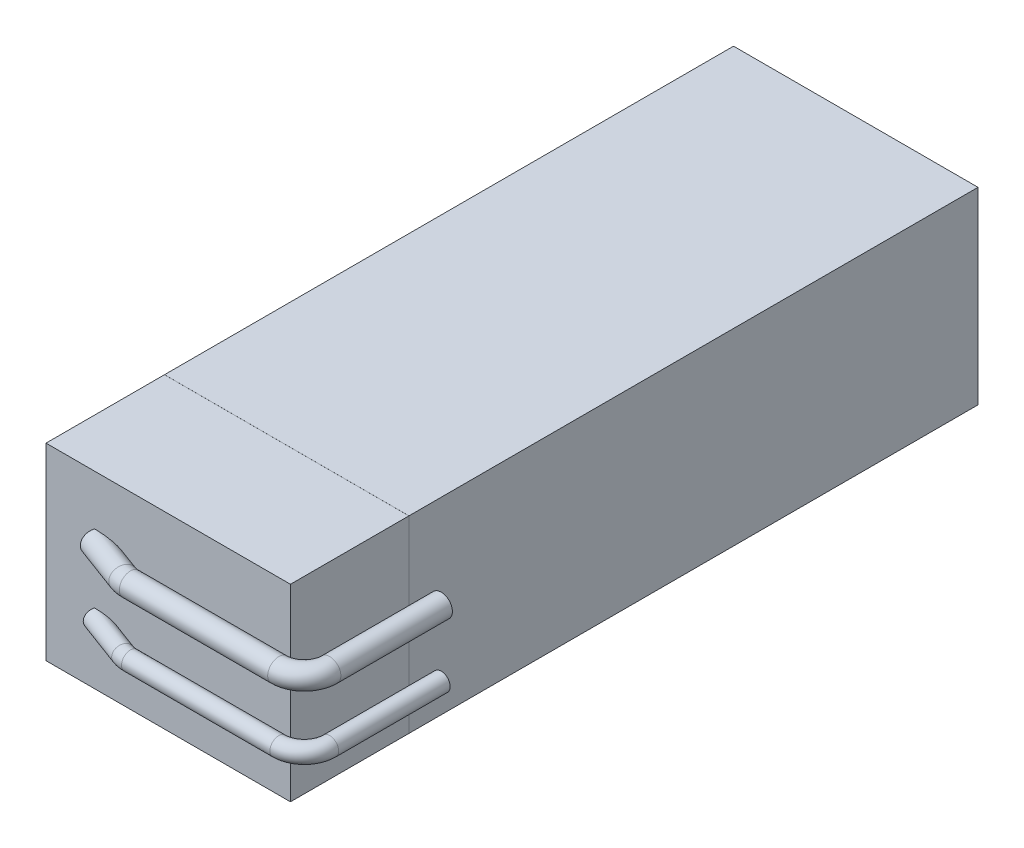
ISO-10303-21;
HEADER;
FILE_DESCRIPTION(('STEP AP214'),'2;1');
FILE_NAME('part.step','',(''),(''),'','','');
FILE_SCHEMA(('AUTOMOTIVE_DESIGN { 1 0 10303 214 1 1 1 1 }'));
ENDSEC;
DATA;
#1=APPLICATION_CONTEXT('core data for automotive mechanical design processes');
#2=APPLICATION_PROTOCOL_DEFINITION('international standard','automotive_design',2000,#1);
#3=PRODUCT_CONTEXT('',#1,'mechanical');
#4=PRODUCT('Part','Part','',(#3));
#5=PRODUCT_RELATED_PRODUCT_CATEGORY('part','',(#4));
#6=PRODUCT_DEFINITION_FORMATION('','',#4);
#7=PRODUCT_DEFINITION_CONTEXT('part definition',#1,'design');
#8=PRODUCT_DEFINITION('design','',#6,#7);
#9=PRODUCT_DEFINITION_SHAPE('','',#8);
#10=(LENGTH_UNIT() NAMED_UNIT(*) SI_UNIT(.MILLI.,.METRE.));
#11=(NAMED_UNIT(*) PLANE_ANGLE_UNIT() SI_UNIT($,.RADIAN.));
#12=(NAMED_UNIT(*) SI_UNIT($,.STERADIAN.) SOLID_ANGLE_UNIT());
#13=UNCERTAINTY_MEASURE_WITH_UNIT(LENGTH_MEASURE(1.E-05),#10,'distance_accuracy_value','');
#14=(GEOMETRIC_REPRESENTATION_CONTEXT(3) GLOBAL_UNCERTAINTY_ASSIGNED_CONTEXT((#13)) GLOBAL_UNIT_ASSIGNED_CONTEXT((#10,
#11,#12)) REPRESENTATION_CONTEXT('',''));
#15=CARTESIAN_POINT('',(0.,0.,0.));
#16=DIRECTION('',(0.,0.,1.));
#17=DIRECTION('',(1.,0.,0.));
#18=AXIS2_PLACEMENT_3D('',#15,#16,#17);
#19=CARTESIAN_POINT('',(48.,37.,0.));
#20=DIRECTION('',(0.,-1.,0.));
#21=DIRECTION('',(0.,0.,-1.));
#22=AXIS2_PLACEMENT_3D('',#19,#20,#21);
#23=PLANE('',#22);
#24=DIRECTION('',(1.,0.,0.));
#25=VECTOR('',#24,1.);
#26=CARTESIAN_POINT('',(0.,37.,111.742100003703));
#27=LINE('',#26,#25);
#28=CARTESIAN_POINT('',(0.,37.,111.742100003703));
#29=VERTEX_POINT('',#28);
#30=CARTESIAN_POINT('',(48.,37.,111.742100003703));
#31=VERTEX_POINT('',#30);
#32=EDGE_CURVE('E92',#29,#31,#27,.T.);
#33=ORIENTED_EDGE('',*,*,#32,.F.);
#34=DIRECTION('',(0.,0.,1.));
#35=VECTOR('',#34,1.);
#36=CARTESIAN_POINT('',(0.,37.,0.));
#37=LINE('',#36,#35);
#38=CARTESIAN_POINT('',(0.,37.,135.));
#39=VERTEX_POINT('',#38);
#40=EDGE_CURVE('E49',#29,#39,#37,.T.);
#41=ORIENTED_EDGE('',*,*,#40,.T.);
#42=DIRECTION('',(-1.,0.,0.));
#43=VECTOR('',#42,1.);
#44=CARTESIAN_POINT('',(48.,37.,135.));
#45=LINE('',#44,#43);
#46=CARTESIAN_POINT('',(48.,37.,135.));
#47=VERTEX_POINT('',#46);
#48=EDGE_CURVE('E121',#47,#39,#45,.T.);
#49=ORIENTED_EDGE('',*,*,#48,.F.);
#50=DIRECTION('',(0.,0.,1.));
#51=VECTOR('',#50,1.);
#52=CARTESIAN_POINT('',(48.,37.,0.));
#53=LINE('',#52,#51);
#54=EDGE_CURVE('E106',#31,#47,#53,.T.);
#55=ORIENTED_EDGE('',*,*,#54,.F.);
#56=EDGE_LOOP('',(#33,#41,#49,#55));
#57=FACE_BOUND('',#56,.T.);
#58=ADVANCED_FACE('F46',(#57),#23,.F.);
#59=CARTESIAN_POINT('',(48.,0.,0.));
#60=DIRECTION('',(0.,1.,0.));
#61=DIRECTION('',(0.,0.,1.));
#62=AXIS2_PLACEMENT_3D('',#59,#60,#61);
#63=PLANE('',#62);
#64=DIRECTION('',(-1.,0.,0.));
#65=VECTOR('',#64,1.);
#66=CARTESIAN_POINT('',(0.,0.,111.742100003703));
#67=LINE('',#66,#65);
#68=CARTESIAN_POINT('',(48.,0.,111.742100003703));
#69=VERTEX_POINT('',#68);
#70=CARTESIAN_POINT('',(0.,0.,111.742100003703));
#71=VERTEX_POINT('',#70);
#72=EDGE_CURVE('E12',#69,#71,#67,.T.);
#73=ORIENTED_EDGE('',*,*,#72,.F.);
#74=DIRECTION('',(0.,0.,-1.));
#75=VECTOR('',#74,1.);
#76=CARTESIAN_POINT('',(48.,0.,0.));
#77=LINE('',#76,#75);
#78=CARTESIAN_POINT('',(48.,0.,135.));
#79=VERTEX_POINT('',#78);
#80=EDGE_CURVE('E118',#79,#69,#77,.T.);
#81=ORIENTED_EDGE('',*,*,#80,.F.);
#82=DIRECTION('',(-1.,0.,0.));
#83=VECTOR('',#82,1.);
#84=CARTESIAN_POINT('',(48.,0.,135.));
#85=LINE('',#84,#83);
#86=CARTESIAN_POINT('',(0.,0.,135.));
#87=VERTEX_POINT('',#86);
#88=EDGE_CURVE('E111',#79,#87,#85,.T.);
#89=ORIENTED_EDGE('',*,*,#88,.T.);
#90=DIRECTION('',(0.,0.,-1.));
#91=VECTOR('',#90,1.);
#92=CARTESIAN_POINT('',(0.,0.,0.));
#93=LINE('',#92,#91);
#94=EDGE_CURVE('E113',#87,#71,#93,.T.);
#95=ORIENTED_EDGE('',*,*,#94,.T.);
#96=EDGE_LOOP('',(#73,#81,#89,#95));
#97=FACE_BOUND('',#96,.T.);
#98=ADVANCED_FACE('F173',(#97),#63,.F.);
#99=CARTESIAN_POINT('',(48.,0.,0.));
#100=DIRECTION('',(1.,0.,0.));
#101=DIRECTION('',(0.,0.,-1.));
#102=AXIS2_PLACEMENT_3D('',#99,#100,#101);
#103=PLANE('',#102);
#104=ORIENTED_EDGE('',*,*,#80,.T.);
#105=DIRECTION('',(0.,-1.,0.));
#106=VECTOR('',#105,1.);
#107=CARTESIAN_POINT('',(48.,0.,111.742100003703));
#108=LINE('',#107,#106);
#109=EDGE_CURVE('E55',#31,#69,#108,.T.);
#110=ORIENTED_EDGE('',*,*,#109,.F.);
#111=ORIENTED_EDGE('',*,*,#54,.T.);
#112=DIRECTION('',(0.,-1.,0.));
#113=VECTOR('',#112,1.);
#114=CARTESIAN_POINT('',(48.,0.,135.));
#115=LINE('',#114,#113);
#116=EDGE_CURVE('E124',#47,#79,#115,.T.);
#117=ORIENTED_EDGE('',*,*,#116,.T.);
#118=EDGE_LOOP('',(#104,#110,#111,#117));
#119=FACE_BOUND('',#118,.T.);
#120=ADVANCED_FACE('F169',(#119),#103,.T.);
#121=CARTESIAN_POINT('',(0.,0.,0.));
#122=DIRECTION('',(1.,0.,0.));
#123=DIRECTION('',(0.,0.,-1.));
#124=AXIS2_PLACEMENT_3D('',#121,#122,#123);
#125=PLANE('',#124);
#126=DIRECTION('',(0.,1.,0.));
#127=VECTOR('',#126,1.);
#128=CARTESIAN_POINT('',(0.,0.,111.742100003703));
#129=LINE('',#128,#127);
#130=EDGE_CURVE('E94',#71,#29,#129,.T.);
#131=ORIENTED_EDGE('',*,*,#130,.F.);
#132=ORIENTED_EDGE('',*,*,#94,.F.);
#133=DIRECTION('',(0.,-1.,0.));
#134=VECTOR('',#133,1.);
#135=CARTESIAN_POINT('',(0.,0.,135.));
#136=LINE('',#135,#134);
#137=EDGE_CURVE('E110',#39,#87,#136,.T.);
#138=ORIENTED_EDGE('',*,*,#137,.F.);
#139=ORIENTED_EDGE('',*,*,#40,.F.);
#140=EDGE_LOOP('',(#131,#132,#138,#139));
#141=FACE_BOUND('',#140,.T.);
#142=ADVANCED_FACE('F109',(#141),#125,.F.);
#143=CARTESIAN_POINT('',(48.,0.,135.));
#144=DIRECTION('',(0.,0.,-1.));
#145=DIRECTION('',(-1.,0.,0.));
#146=AXIS2_PLACEMENT_3D('',#143,#144,#145);
#147=PLANE('',#146);
#148=DIRECTION('',(0.,-1.,0.));
#149=VECTOR('',#148,1.);
#150=CARTESIAN_POINT('',(9.55982750656041,0.,135.));
#151=LINE('',#150,#149);
#152=CARTESIAN_POINT('',(9.55982750656041,27.1877252010003,135.));
#153=VERTEX_POINT('',#152);
#154=CARTESIAN_POINT('',(9.55982750656041,22.8122747989997,135.));
#155=VERTEX_POINT('',#154);
#156=EDGE_CURVE('E134',#153,#155,#151,.T.);
#157=ORIENTED_EDGE('',*,*,#156,.F.);
#158=CARTESIAN_POINT('',(9.55982750656043,25.,135.));
#159=DIRECTION('',(0.,0.,-1.));
#160=DIRECTION('',(-1.,0.,0.));
#161=AXIS2_PLACEMENT_3D('',#158,#159,#160);
#162=ELLIPSE('',#161,6.26967326638381,2.18772520100031);
#163=EDGE_CURVE('E150',#155,#153,#162,.F.);
#164=ORIENTED_EDGE('',*,*,#163,.F.);
#165=EDGE_LOOP('',(#157,#164));
#166=FACE_BOUND('',#165,.T.);
#167=DIRECTION('',(0.,-1.,0.));
#168=VECTOR('',#167,1.);
#169=CARTESIAN_POINT('',(9.55982750656041,0.,135.));
#170=LINE('',#169,#168);
#171=CARTESIAN_POINT('',(9.55982750656041,13.75,135.));
#172=VERTEX_POINT('',#171);
#173=CARTESIAN_POINT('',(9.55982750656041,10.25,135.));
#174=VERTEX_POINT('',#173);
#175=EDGE_CURVE('E130',#172,#174,#170,.T.);
#176=ORIENTED_EDGE('',*,*,#175,.F.);
#177=CARTESIAN_POINT('',(9.55982750656043,12.,135.));
#178=DIRECTION('',(0.,0.,-1.));
#179=DIRECTION('',(-1.,0.,0.));
#180=AXIS2_PLACEMENT_3D('',#177,#178,#179);
#181=ELLIPSE('',#180,5.01522230084241,1.75);
#182=EDGE_CURVE('E129',#174,#172,#181,.F.);
#183=ORIENTED_EDGE('',*,*,#182,.F.);
#184=EDGE_LOOP('',(#176,#183));
#185=FACE_BOUND('',#184,.T.);
#186=ORIENTED_EDGE('',*,*,#137,.T.);
#187=ORIENTED_EDGE('',*,*,#88,.F.);
#188=ORIENTED_EDGE('',*,*,#116,.F.);
#189=ORIENTED_EDGE('',*,*,#48,.T.);
#190=EDGE_LOOP('',(#186,#187,#188,#189));
#191=FACE_BOUND('',#190,.T.);
#192=ADVANCED_FACE('F172',(#166,#185,#191),#147,.F.);
#193=CARTESIAN_POINT('',(9.55982750656041,12.,135.));
#194=DIRECTION('',(0.937145933275446,0.,0.348937673152804));
#195=DIRECTION('',(0.348937673152804,0.,-0.937145933275446));
#196=AXIS2_PLACEMENT_3D('',#193,#194,#195);
#197=PLANE('',#196);
#198=CARTESIAN_POINT('',(9.55982750656041,12.,135.));
#199=DIRECTION('',(0.937145933275446,0.,0.348937673152804));
#200=DIRECTION('',(0.348937673152804,0.,-0.937145933275446));
#201=AXIS2_PLACEMENT_3D('',#198,#199,#200);
#202=CIRCLE('',#201,1.75);
#203=EDGE_CURVE('E126',#172,#174,#202,.T.);
#204=ORIENTED_EDGE('',*,*,#203,.F.);
#205=ORIENTED_EDGE('',*,*,#175,.T.);
#206=EDGE_LOOP('',(#204,#205));
#207=FACE_BOUND('',#206,.T.);
#208=ADVANCED_FACE('F233',(#207),#197,.F.);
#209=CARTESIAN_POINT('',(18.4574449031654,12.,138.312946042591));
#210=DIRECTION('',(-0.937145933275446,0.,-0.348937673152804));
#211=DIRECTION('',(-0.348937673152804,0.,0.937145933275446));
#212=AXIS2_PLACEMENT_3D('',#209,#210,#211);
#213=CYLINDRICAL_SURFACE('',#212,1.75);
#214=CARTESIAN_POINT('',(18.4574449031654,12.,138.312946042591));
#215=DIRECTION('',(0.937145933275445,0.,0.348937673152806));
#216=DIRECTION('',(0.348937673152806,0.,-0.937145933275445));
#217=AXIS2_PLACEMENT_3D('',#214,#215,#216);
#218=CIRCLE('',#217,1.75);
#219=CARTESIAN_POINT('',(17.846803975148,12.,139.952951425823));
#220=VERTEX_POINT('',#219);
#221=EDGE_CURVE('E131',#220,#220,#218,.T.);
#222=ORIENTED_EDGE('',*,*,#221,.F.);
#223=EDGE_LOOP('',(#222));
#224=FACE_BOUND('',#223,.T.);
#225=ORIENTED_EDGE('',*,*,#203,.T.);
#226=ORIENTED_EDGE('',*,*,#182,.T.);
#227=EDGE_LOOP('',(#225,#226));
#228=FACE_BOUND('',#227,.T.);
#229=ADVANCED_FACE('F230',(#224,#228),#213,.T.);
#230=CARTESIAN_POINT('',(54.3424294324666,12.,111.732100003703));
#231=DIRECTION('',(0.,0.,-1.));
#232=DIRECTION('',(-1.,0.,0.));
#233=AXIS2_PLACEMENT_3D('',#230,#231,#232);
#234=PLANE('',#233);
#235=CARTESIAN_POINT('',(54.3424294324666,12.,111.732100003703));
#236=DIRECTION('',(0.,0.,-1.));
#237=DIRECTION('',(-1.,0.,0.));
#238=AXIS2_PLACEMENT_3D('',#235,#236,#237);
#239=CIRCLE('',#238,1.75);
#240=CARTESIAN_POINT('',(52.5924294324666,12.,111.732100003703));
#241=VERTEX_POINT('',#240);
#242=EDGE_CURVE('E144',#241,#241,#239,.T.);
#243=ORIENTED_EDGE('',*,*,#242,.T.);
#244=EDGE_LOOP('',(#243));
#245=FACE_BOUND('',#244,.T.);
#246=ADVANCED_FACE('F211',(#245),#234,.T.);
#247=CARTESIAN_POINT('',(54.3424294324666,12.,111.732100003703));
#248=DIRECTION('',(0.,0.,1.));
#249=DIRECTION('',(1.,0.,0.));
#250=AXIS2_PLACEMENT_3D('',#247,#248,#249);
#251=CYLINDRICAL_SURFACE('',#250,1.75);
#252=CARTESIAN_POINT('',(54.3424294324666,12.,133.627216376214));
#253=DIRECTION('',(0.,0.,-1.));
#254=DIRECTION('',(-1.,0.,0.));
#255=AXIS2_PLACEMENT_3D('',#252,#253,#254);
#256=CIRCLE('',#255,1.75);
#257=CARTESIAN_POINT('',(56.092429432466,12.,133.627216376214));
#258=VERTEX_POINT('',#257);
#259=EDGE_CURVE('E141',#258,#258,#256,.T.);
#260=ORIENTED_EDGE('',*,*,#259,.T.);
#261=EDGE_LOOP('',(#260));
#262=FACE_BOUND('',#261,.T.);
#263=ORIENTED_EDGE('',*,*,#242,.F.);
#264=EDGE_LOOP('',(#263));
#265=FACE_BOUND('',#264,.T.);
#266=ADVANCED_FACE('F215',(#262,#265),#251,.T.);
#267=CARTESIAN_POINT('',(49.3424294324666,12.,133.627216376214));
#268=DIRECTION('',(0.,-1.,0.));
#269=DIRECTION('',(0.,0.,-1.));
#270=AXIS2_PLACEMENT_3D('',#267,#268,#269);
#271=TOROIDAL_SURFACE('',#270,4.99999999999938,1.75);
#272=CARTESIAN_POINT('',(49.3424294324665,12.,138.627216376214));
#273=DIRECTION('',(1.,0.,0.));
#274=DIRECTION('',(0.,0.,-1.));
#275=AXIS2_PLACEMENT_3D('',#272,#273,#274);
#276=CIRCLE('',#275,1.75);
#277=CARTESIAN_POINT('',(49.3424294324665,12.,140.377216376213));
#278=VERTEX_POINT('',#277);
#279=EDGE_CURVE('E138',#278,#278,#276,.T.);
#280=CARTESIAN_POINT('',(49.3424294324666,12.,133.627216376214));
#281=DIRECTION('',(0.,-1.,0.));
#282=DIRECTION('',(0.,0.,-1.));
#283=AXIS2_PLACEMENT_3D('',#280,#281,#282);
#284=CIRCLE('',#283,6.74999999999938);
#285=EDGE_CURVE('',#258,#278,#284,.T.);
#286=ORIENTED_EDGE('',*,*,#259,.F.);
#287=ORIENTED_EDGE('',*,*,#279,.T.);
#288=ORIENTED_EDGE('',*,*,#285,.T.);
#289=ORIENTED_EDGE('',*,*,#285,.F.);
#290=EDGE_LOOP('',(#286,#288,#287,#289));
#291=FACE_BOUND('',#290,.T.);
#292=ADVANCED_FACE('F218',(#291),#271,.T.);
#293=CARTESIAN_POINT('',(49.3424294324666,12.,138.627216376214));
#294=DIRECTION('',(-1.,0.,0.));
#295=DIRECTION('',(0.,0.,1.));
#296=AXIS2_PLACEMENT_3D('',#293,#294,#295);
#297=CYLINDRICAL_SURFACE('',#296,1.75);
#298=CARTESIAN_POINT('',(20.2021332689294,12.,138.627216376214));
#299=DIRECTION('',(1.,0.,0.));
#300=DIRECTION('',(0.,0.,-1.));
#301=AXIS2_PLACEMENT_3D('',#298,#299,#300);
#302=CIRCLE('',#301,1.75);
#303=CARTESIAN_POINT('',(20.2021332689294,12.,140.377216376214));
#304=VERTEX_POINT('',#303);
#305=EDGE_CURVE('E135',#304,#304,#302,.T.);
#306=ORIENTED_EDGE('',*,*,#305,.T.);
#307=EDGE_LOOP('',(#306));
#308=FACE_BOUND('',#307,.T.);
#309=ORIENTED_EDGE('',*,*,#279,.F.);
#310=EDGE_LOOP('',(#309));
#311=FACE_BOUND('',#310,.T.);
#312=ADVANCED_FACE('F222',(#308,#311),#297,.T.);
#313=CARTESIAN_POINT('',(20.2021332689294,12.,133.627216376214));
#314=DIRECTION('',(0.,-1.,0.));
#315=DIRECTION('',(0.,0.,-1.));
#316=AXIS2_PLACEMENT_3D('',#313,#314,#315);
#317=TOROIDAL_SURFACE('',#316,5.,1.75);
#318=CARTESIAN_POINT('',(20.2021332689294,12.,133.627216376214));
#319=DIRECTION('',(0.,-1.,0.));
#320=DIRECTION('',(0.,0.,-1.));
#321=AXIS2_PLACEMENT_3D('',#318,#319,#320);
#322=CIRCLE('',#321,6.75000000000001);
#323=EDGE_CURVE('',#304,#220,#322,.T.);
#324=ORIENTED_EDGE('',*,*,#305,.F.);
#325=ORIENTED_EDGE('',*,*,#221,.T.);
#326=ORIENTED_EDGE('',*,*,#323,.T.);
#327=ORIENTED_EDGE('',*,*,#323,.F.);
#328=EDGE_LOOP('',(#324,#326,#325,#327));
#329=FACE_BOUND('',#328,.T.);
#330=ADVANCED_FACE('F209',(#329),#317,.T.);
#331=CARTESIAN_POINT('',(9.55982750656041,25.,135.));
#332=DIRECTION('',(0.937145933275446,0.,0.348937673152804));
#333=DIRECTION('',(0.348937673152804,0.,-0.937145933275446));
#334=AXIS2_PLACEMENT_3D('',#331,#332,#333);
#335=PLANE('',#334);
#336=CARTESIAN_POINT('',(9.55982750656041,25.,135.));
#337=DIRECTION('',(0.937145933275446,0.,0.348937673152804));
#338=DIRECTION('',(0.348937673152804,0.,-0.937145933275446));
#339=AXIS2_PLACEMENT_3D('',#336,#337,#338);
#340=CIRCLE('',#339,2.18772520100031);
#341=EDGE_CURVE('E147',#153,#155,#340,.T.);
#342=ORIENTED_EDGE('',*,*,#341,.F.);
#343=ORIENTED_EDGE('',*,*,#156,.T.);
#344=EDGE_LOOP('',(#342,#343));
#345=FACE_BOUND('',#344,.T.);
#346=ADVANCED_FACE('F205',(#345),#335,.F.);
#347=CARTESIAN_POINT('',(18.4574449031654,25.,138.312946042591));
#348=DIRECTION('',(-0.937145933275446,0.,-0.348937673152804));
#349=DIRECTION('',(-0.348937673152804,0.,0.937145933275446));
#350=AXIS2_PLACEMENT_3D('',#347,#348,#349);
#351=CYLINDRICAL_SURFACE('',#350,2.18772520100031);
#352=CARTESIAN_POINT('',(18.4574449031654,25.,138.312946042591));
#353=DIRECTION('',(0.937145933275445,0.,0.348937673152806));
#354=DIRECTION('',(0.348937673152806,0.,-0.937145933275445));
#355=AXIS2_PLACEMENT_3D('',#352,#353,#354);
#356=CIRCLE('',#355,2.18772520100031);
#357=CARTESIAN_POINT('',(17.6940651620306,25.,140.363163817833));
#358=VERTEX_POINT('',#357);
#359=EDGE_CURVE('E100',#358,#358,#356,.T.);
#360=ORIENTED_EDGE('',*,*,#359,.F.);
#361=EDGE_LOOP('',(#360));
#362=FACE_BOUND('',#361,.T.);
#363=ORIENTED_EDGE('',*,*,#341,.T.);
#364=ORIENTED_EDGE('',*,*,#163,.T.);
#365=EDGE_LOOP('',(#363,#364));
#366=FACE_BOUND('',#365,.T.);
#367=ADVANCED_FACE('F202',(#362,#366),#351,.T.);
#368=CARTESIAN_POINT('',(54.3424294324666,25.,111.732100003703));
#369=DIRECTION('',(0.,0.,-1.));
#370=DIRECTION('',(-1.,0.,0.));
#371=AXIS2_PLACEMENT_3D('',#368,#369,#370);
#372=PLANE('',#371);
#373=CARTESIAN_POINT('',(54.3424294324666,25.,111.732100003703));
#374=DIRECTION('',(0.,0.,-1.));
#375=DIRECTION('',(-1.,0.,0.));
#376=AXIS2_PLACEMENT_3D('',#373,#374,#375);
#377=CIRCLE('',#376,2.18772520100031);
#378=CARTESIAN_POINT('',(52.1547042314663,25.,111.732100003703));
#379=VERTEX_POINT('',#378);
#380=EDGE_CURVE('E162',#379,#379,#377,.T.);
#381=ORIENTED_EDGE('',*,*,#380,.T.);
#382=EDGE_LOOP('',(#381));
#383=FACE_BOUND('',#382,.T.);
#384=ADVANCED_FACE('F186',(#383),#372,.T.);
#385=CARTESIAN_POINT('',(54.3424294324666,25.,111.732100003703));
#386=DIRECTION('',(0.,0.,1.));
#387=DIRECTION('',(1.,0.,0.));
#388=AXIS2_PLACEMENT_3D('',#385,#386,#387);
#389=CYLINDRICAL_SURFACE('',#388,2.18772520100031);
#390=CARTESIAN_POINT('',(54.3424294324666,25.,133.627216376214));
#391=DIRECTION('',(0.,0.,-1.));
#392=DIRECTION('',(-1.,0.,0.));
#393=AXIS2_PLACEMENT_3D('',#390,#391,#392);
#394=CIRCLE('',#393,2.18772520100031);
#395=CARTESIAN_POINT('',(56.5301546334663,25.,133.627216376214));
#396=VERTEX_POINT('',#395);
#397=EDGE_CURVE('E159',#396,#396,#394,.T.);
#398=ORIENTED_EDGE('',*,*,#397,.T.);
#399=EDGE_LOOP('',(#398));
#400=FACE_BOUND('',#399,.T.);
#401=ORIENTED_EDGE('',*,*,#380,.F.);
#402=EDGE_LOOP('',(#401));
#403=FACE_BOUND('',#402,.T.);
#404=ADVANCED_FACE('F187',(#400,#403),#389,.T.);
#405=CARTESIAN_POINT('',(49.3424294324666,25.,133.627216376214));
#406=DIRECTION('',(0.,-1.,0.));
#407=DIRECTION('',(0.,0.,-1.));
#408=AXIS2_PLACEMENT_3D('',#405,#406,#407);
#409=TOROIDAL_SURFACE('',#408,4.99999999999938,2.18772520100031);
#410=CARTESIAN_POINT('',(49.3424294324665,25.,138.627216376214));
#411=DIRECTION('',(1.,0.,0.));
#412=DIRECTION('',(0.,0.,-1.));
#413=AXIS2_PLACEMENT_3D('',#410,#411,#412);
#414=CIRCLE('',#413,2.18772520100031);
#415=CARTESIAN_POINT('',(49.3424294324665,25.,140.814941577214));
#416=VERTEX_POINT('',#415);
#417=EDGE_CURVE('E156',#416,#416,#414,.T.);
#418=CARTESIAN_POINT('',(49.3424294324666,25.,133.627216376214));
#419=DIRECTION('',(0.,-1.,0.));
#420=DIRECTION('',(0.,0.,-1.));
#421=AXIS2_PLACEMENT_3D('',#418,#419,#420);
#422=CIRCLE('',#421,7.18772520099969);
#423=EDGE_CURVE('',#396,#416,#422,.T.);
#424=ORIENTED_EDGE('',*,*,#397,.F.);
#425=ORIENTED_EDGE('',*,*,#417,.T.);
#426=ORIENTED_EDGE('',*,*,#423,.T.);
#427=ORIENTED_EDGE('',*,*,#423,.F.);
#428=EDGE_LOOP('',(#424,#426,#425,#427));
#429=FACE_BOUND('',#428,.T.);
#430=ADVANCED_FACE('F190',(#429),#409,.T.);
#431=CARTESIAN_POINT('',(49.3424294324666,25.,138.627216376214));
#432=DIRECTION('',(-1.,0.,0.));
#433=DIRECTION('',(0.,0.,1.));
#434=AXIS2_PLACEMENT_3D('',#431,#432,#433);
#435=CYLINDRICAL_SURFACE('',#434,2.18772520100031);
#436=CARTESIAN_POINT('',(20.2021332689294,25.,138.627216376214));
#437=DIRECTION('',(1.,0.,0.));
#438=DIRECTION('',(0.,0.,-1.));
#439=AXIS2_PLACEMENT_3D('',#436,#437,#438);
#440=CIRCLE('',#439,2.18772520100031);
#441=CARTESIAN_POINT('',(20.2021332689294,25.,140.814941577214));
#442=VERTEX_POINT('',#441);
#443=EDGE_CURVE('E153',#442,#442,#440,.T.);
#444=ORIENTED_EDGE('',*,*,#443,.T.);
#445=EDGE_LOOP('',(#444));
#446=FACE_BOUND('',#445,.T.);
#447=ORIENTED_EDGE('',*,*,#417,.F.);
#448=EDGE_LOOP('',(#447));
#449=FACE_BOUND('',#448,.T.);
#450=ADVANCED_FACE('F194',(#446,#449),#435,.T.);
#451=CARTESIAN_POINT('',(20.2021332689294,25.,133.627216376214));
#452=DIRECTION('',(0.,-1.,0.));
#453=DIRECTION('',(0.,0.,-1.));
#454=AXIS2_PLACEMENT_3D('',#451,#452,#453);
#455=TOROIDAL_SURFACE('',#454,5.,2.18772520100031);
#456=CARTESIAN_POINT('',(20.2021332689294,25.,133.627216376214));
#457=DIRECTION('',(0.,-1.,0.));
#458=DIRECTION('',(0.,0.,-1.));
#459=AXIS2_PLACEMENT_3D('',#456,#457,#458);
#460=CIRCLE('',#459,7.18772520100031);
#461=EDGE_CURVE('',#442,#358,#460,.T.);
#462=ORIENTED_EDGE('',*,*,#443,.F.);
#463=ORIENTED_EDGE('',*,*,#359,.T.);
#464=ORIENTED_EDGE('',*,*,#461,.T.);
#465=ORIENTED_EDGE('',*,*,#461,.F.);
#466=EDGE_LOOP('',(#462,#464,#463,#465));
#467=FACE_BOUND('',#466,.T.);
#468=ADVANCED_FACE('F185',(#467),#455,.T.);
#469=CARTESIAN_POINT('',(0.,0.,111.742100003703));
#470=DIRECTION('',(0.,0.,-1.));
#471=DIRECTION('',(-1.,0.,0.));
#472=AXIS2_PLACEMENT_3D('',#469,#470,#471);
#473=PLANE('',#472);
#474=ORIENTED_EDGE('',*,*,#130,.T.);
#475=ORIENTED_EDGE('',*,*,#32,.T.);
#476=ORIENTED_EDGE('',*,*,#109,.T.);
#477=ORIENTED_EDGE('',*,*,#72,.T.);
#478=EDGE_LOOP('',(#474,#475,#476,#477));
#479=FACE_BOUND('',#478,.T.);
#480=ADVANCED_FACE('F95',(#479),#473,.T.);
#481=CLOSED_SHELL('',(#58,#98,#120,#142,#192,#208,#229,#246,#266,#292,#312,#330,#346,#367,#384,
#404,#430,#450,#468,#480));
#482=MANIFOLD_SOLID_BREP('B2',#481);
#483=CARTESIAN_POINT('',(48.,0.,0.));
#484=DIRECTION('',(0.,0.,1.));
#485=DIRECTION('',(1.,0.,0.));
#486=AXIS2_PLACEMENT_3D('',#483,#484,#485);
#487=PLANE('',#486);
#488=DIRECTION('',(0.,1.,0.));
#489=VECTOR('',#488,1.);
#490=CARTESIAN_POINT('',(0.,0.,0.));
#491=LINE('',#490,#489);
#492=CARTESIAN_POINT('',(0.,0.,0.));
#493=VERTEX_POINT('',#492);
#494=CARTESIAN_POINT('',(0.,37.,0.));
#495=VERTEX_POINT('',#494);
#496=EDGE_CURVE('E474',#493,#495,#491,.T.);
#497=ORIENTED_EDGE('',*,*,#496,.T.);
#498=DIRECTION('',(-1.,0.,0.));
#499=VECTOR('',#498,1.);
#500=CARTESIAN_POINT('',(48.,37.,0.));
#501=LINE('',#500,#499);
#502=CARTESIAN_POINT('',(48.,37.,0.));
#503=VERTEX_POINT('',#502);
#504=EDGE_CURVE('E44',#503,#495,#501,.T.);
#505=ORIENTED_EDGE('',*,*,#504,.F.);
#506=DIRECTION('',(0.,1.,0.));
#507=VECTOR('',#506,1.);
#508=CARTESIAN_POINT('',(48.,0.,0.));
#509=LINE('',#508,#507);
#510=CARTESIAN_POINT('',(48.,0.,0.));
#511=VERTEX_POINT('',#510);
#512=EDGE_CURVE('E468',#511,#503,#509,.T.);
#513=ORIENTED_EDGE('',*,*,#512,.F.);
#514=DIRECTION('',(-1.,0.,0.));
#515=VECTOR('',#514,1.);
#516=CARTESIAN_POINT('',(48.,0.,0.));
#517=LINE('',#516,#515);
#518=EDGE_CURVE('E430',#511,#493,#517,.T.);
#519=ORIENTED_EDGE('',*,*,#518,.T.);
#520=EDGE_LOOP('',(#497,#505,#513,#519));
#521=FACE_BOUND('',#520,.T.);
#522=ADVANCED_FACE('F423',(#521),#487,.F.);
#523=CARTESIAN_POINT('',(0.,0.,0.));
#524=DIRECTION('',(1.,0.,0.));
#525=DIRECTION('',(0.,0.,-1.));
#526=AXIS2_PLACEMENT_3D('',#523,#524,#525);
#527=PLANE('',#526);
#528=DIRECTION('',(0.,0.,-1.));
#529=VECTOR('',#528,1.);
#530=CARTESIAN_POINT('',(0.,0.,0.));
#531=LINE('',#530,#529);
#532=CARTESIAN_POINT('',(0.,0.,111.732100003703));
#533=VERTEX_POINT('',#532);
#534=EDGE_CURVE('E460',#533,#493,#531,.T.);
#535=ORIENTED_EDGE('',*,*,#534,.F.);
#536=DIRECTION('',(0.,1.,0.));
#537=VECTOR('',#536,1.);
#538=CARTESIAN_POINT('',(0.,0.,111.732100003703));
#539=LINE('',#538,#537);
#540=CARTESIAN_POINT('',(0.,37.,111.732100003703));
#541=VERTEX_POINT('',#540);
#542=EDGE_CURVE('E489',#533,#541,#539,.T.);
#543=ORIENTED_EDGE('',*,*,#542,.T.);
#544=DIRECTION('',(0.,0.,1.));
#545=VECTOR('',#544,1.);
#546=CARTESIAN_POINT('',(0.,37.,0.));
#547=LINE('',#546,#545);
#548=EDGE_CURVE('E469',#495,#541,#547,.T.);
#549=ORIENTED_EDGE('',*,*,#548,.F.);
#550=ORIENTED_EDGE('',*,*,#496,.F.);
#551=EDGE_LOOP('',(#535,#543,#549,#550));
#552=FACE_BOUND('',#551,.T.);
#553=ADVANCED_FACE('F475',(#552),#527,.F.);
#554=CARTESIAN_POINT('',(48.,0.,0.));
#555=DIRECTION('',(1.,0.,0.));
#556=DIRECTION('',(0.,0.,-1.));
#557=AXIS2_PLACEMENT_3D('',#554,#555,#556);
#558=PLANE('',#557);
#559=DIRECTION('',(0.,-1.,0.));
#560=VECTOR('',#559,1.);
#561=CARTESIAN_POINT('',(48.,0.,111.732100003703));
#562=LINE('',#561,#560);
#563=CARTESIAN_POINT('',(48.,37.,111.732100003703));
#564=VERTEX_POINT('',#563);
#565=CARTESIAN_POINT('',(48.,0.,111.732100003703));
#566=VERTEX_POINT('',#565);
#567=EDGE_CURVE('E479',#564,#566,#562,.T.);
#568=ORIENTED_EDGE('',*,*,#567,.T.);
#569=DIRECTION('',(0.,0.,-1.));
#570=VECTOR('',#569,1.);
#571=CARTESIAN_POINT('',(48.,0.,0.));
#572=LINE('',#571,#570);
#573=EDGE_CURVE('E446',#566,#511,#572,.T.);
#574=ORIENTED_EDGE('',*,*,#573,.T.);
#575=ORIENTED_EDGE('',*,*,#512,.T.);
#576=DIRECTION('',(0.,0.,1.));
#577=VECTOR('',#576,1.);
#578=CARTESIAN_POINT('',(48.,37.,0.));
#579=LINE('',#578,#577);
#580=EDGE_CURVE('E483',#503,#564,#579,.T.);
#581=ORIENTED_EDGE('',*,*,#580,.T.);
#582=EDGE_LOOP('',(#568,#574,#575,#581));
#583=FACE_BOUND('',#582,.T.);
#584=ADVANCED_FACE('F493',(#583),#558,.T.);
#585=CARTESIAN_POINT('',(48.,0.,0.));
#586=DIRECTION('',(0.,1.,0.));
#587=DIRECTION('',(0.,0.,1.));
#588=AXIS2_PLACEMENT_3D('',#585,#586,#587);
#589=PLANE('',#588);
#590=ORIENTED_EDGE('',*,*,#573,.F.);
#591=DIRECTION('',(-1.,0.,0.));
#592=VECTOR('',#591,1.);
#593=CARTESIAN_POINT('',(0.,0.,111.732100003703));
#594=LINE('',#593,#592);
#595=EDGE_CURVE('E465',#566,#533,#594,.T.);
#596=ORIENTED_EDGE('',*,*,#595,.T.);
#597=ORIENTED_EDGE('',*,*,#534,.T.);
#598=ORIENTED_EDGE('',*,*,#518,.F.);
#599=EDGE_LOOP('',(#590,#596,#597,#598));
#600=FACE_BOUND('',#599,.T.);
#601=ADVANCED_FACE('F462',(#600),#589,.F.);
#602=CARTESIAN_POINT('',(48.,37.,0.));
#603=DIRECTION('',(0.,-1.,0.));
#604=DIRECTION('',(0.,0.,-1.));
#605=AXIS2_PLACEMENT_3D('',#602,#603,#604);
#606=PLANE('',#605);
#607=ORIENTED_EDGE('',*,*,#548,.T.);
#608=DIRECTION('',(1.,0.,0.));
#609=VECTOR('',#608,1.);
#610=CARTESIAN_POINT('',(0.,37.,111.732100003703));
#611=LINE('',#610,#609);
#612=EDGE_CURVE('E437',#541,#564,#611,.T.);
#613=ORIENTED_EDGE('',*,*,#612,.T.);
#614=ORIENTED_EDGE('',*,*,#580,.F.);
#615=ORIENTED_EDGE('',*,*,#504,.T.);
#616=EDGE_LOOP('',(#607,#613,#614,#615));
#617=FACE_BOUND('',#616,.T.);
#618=ADVANCED_FACE('F491',(#617),#606,.F.);
#619=CARTESIAN_POINT('',(0.,0.,111.732100003703));
#620=DIRECTION('',(0.,0.,-1.));
#621=DIRECTION('',(-1.,0.,0.));
#622=AXIS2_PLACEMENT_3D('',#619,#620,#621);
#623=PLANE('',#622);
#624=ORIENTED_EDGE('',*,*,#542,.F.);
#625=ORIENTED_EDGE('',*,*,#595,.F.);
#626=ORIENTED_EDGE('',*,*,#567,.F.);
#627=ORIENTED_EDGE('',*,*,#612,.F.);
#628=EDGE_LOOP('',(#624,#625,#626,#627));
#629=FACE_BOUND('',#628,.T.);
#630=ADVANCED_FACE('F531',(#629),#623,.F.);
#631=CLOSED_SHELL('',(#522,#553,#584,#601,#618,#630));
#632=MANIFOLD_SOLID_BREP('B6',#631);
#633=ADVANCED_BREP_SHAPE_REPRESENTATION('',(#18,#482,#632),#14);
#634=SHAPE_DEFINITION_REPRESENTATION(#9,#633);
ENDSEC;
END-ISO-10303-21;
